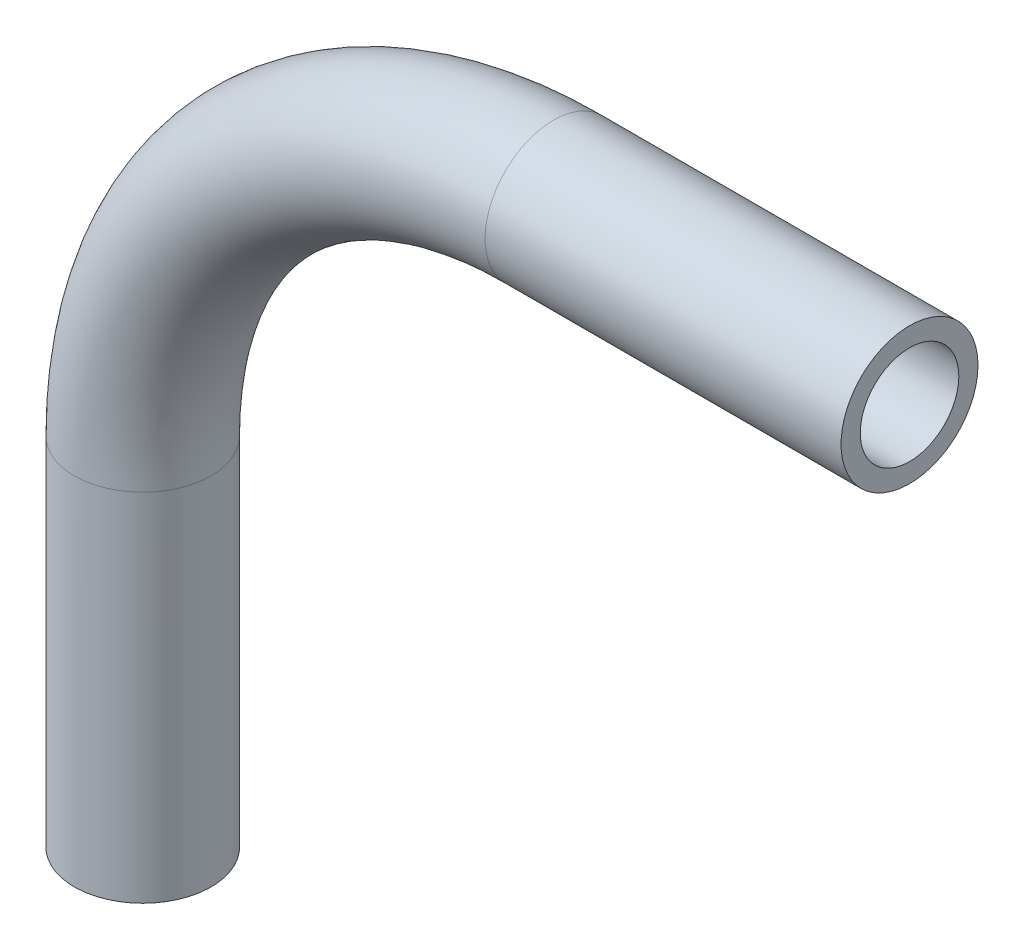
ISO-10303-21;
HEADER;
FILE_DESCRIPTION(('STEP AP214'),'2;1');
FILE_NAME('part.step','',(''),(''),'','','');
FILE_SCHEMA(('AUTOMOTIVE_DESIGN { 1 0 10303 214 1 1 1 1 }'));
ENDSEC;
DATA;
#1=APPLICATION_CONTEXT('core data for automotive mechanical design processes');
#2=APPLICATION_PROTOCOL_DEFINITION('international standard','automotive_design',2000,#1);
#3=PRODUCT_CONTEXT('',#1,'mechanical');
#4=PRODUCT('Part','Part','',(#3));
#5=PRODUCT_RELATED_PRODUCT_CATEGORY('part','',(#4));
#6=PRODUCT_DEFINITION_FORMATION('','',#4);
#7=PRODUCT_DEFINITION_CONTEXT('part definition',#1,'design');
#8=PRODUCT_DEFINITION('design','',#6,#7);
#9=PRODUCT_DEFINITION_SHAPE('','',#8);
#10=(LENGTH_UNIT() NAMED_UNIT(*) SI_UNIT(.MILLI.,.METRE.));
#11=(NAMED_UNIT(*) PLANE_ANGLE_UNIT() SI_UNIT($,.RADIAN.));
#12=(NAMED_UNIT(*) SI_UNIT($,.STERADIAN.) SOLID_ANGLE_UNIT());
#13=UNCERTAINTY_MEASURE_WITH_UNIT(LENGTH_MEASURE(1.E-05),#10,'distance_accuracy_value','');
#14=(GEOMETRIC_REPRESENTATION_CONTEXT(3) GLOBAL_UNCERTAINTY_ASSIGNED_CONTEXT((#13)) GLOBAL_UNIT_ASSIGNED_CONTEXT((#10,
#11,#12)) REPRESENTATION_CONTEXT('',''));
#15=CARTESIAN_POINT('',(0.,0.,0.));
#16=DIRECTION('',(0.,0.,1.));
#17=DIRECTION('',(1.,0.,0.));
#18=AXIS2_PLACEMENT_3D('',#15,#16,#17);
#19=CARTESIAN_POINT('',(0.,-18.0323178807947,0.));
#20=DIRECTION('',(0.,1.,0.));
#21=DIRECTION('',(0.,0.,1.));
#22=AXIS2_PLACEMENT_3D('',#19,#20,#21);
#23=CYLINDRICAL_SURFACE('',#22,3.175);
#24=CARTESIAN_POINT('',(0.,-1.52231788079483,0.));
#25=DIRECTION('',(0.,1.,0.));
#26=DIRECTION('',(0.,0.,-1.));
#27=AXIS2_PLACEMENT_3D('',#24,#25,#26);
#28=CIRCLE('',#27,3.175);
#29=CARTESIAN_POINT('',(-3.175,-1.52231788079486,0.));
#30=VERTEX_POINT('',#29);
#31=EDGE_CURVE('E79',#30,#30,#28,.T.);
#32=ORIENTED_EDGE('',*,*,#31,.F.);
#33=EDGE_LOOP('',(#32));
#34=FACE_BOUND('',#33,.T.);
#35=CARTESIAN_POINT('',(0.,-18.0323178807947,0.));
#36=DIRECTION('',(0.,1.,0.));
#37=DIRECTION('',(0.,0.,-1.));
#38=AXIS2_PLACEMENT_3D('',#35,#36,#37);
#39=CIRCLE('',#38,3.175);
#40=CARTESIAN_POINT('',(0.,-18.0323178807947,-3.175));
#41=VERTEX_POINT('',#40);
#42=EDGE_CURVE('E48',#41,#41,#39,.T.);
#43=ORIENTED_EDGE('',*,*,#42,.T.);
#44=EDGE_LOOP('',(#43));
#45=FACE_BOUND('',#44,.T.);
#46=ADVANCED_FACE('F33',(#34,#45),#23,.T.);
#47=CARTESIAN_POINT('',(19.05,-1.52231788079469,0.));
#48=DIRECTION('',(0.,0.,-1.));
#49=DIRECTION('',(-1.,0.,0.));
#50=AXIS2_PLACEMENT_3D('',#47,#48,#49);
#51=TOROIDAL_SURFACE('',#50,19.05,3.175);
#52=CARTESIAN_POINT('',(19.05,17.5276821192056,0.));
#53=DIRECTION('',(1.,0.,0.));
#54=DIRECTION('',(0.,0.,-1.));
#55=AXIS2_PLACEMENT_3D('',#52,#53,#54);
#56=CIRCLE('',#55,3.175);
#57=CARTESIAN_POINT('',(19.05,20.7026821192053,0.));
#58=VERTEX_POINT('',#57);
#59=EDGE_CURVE('E37',#58,#58,#56,.T.);
#60=CARTESIAN_POINT('',(19.05,-1.52231788079469,0.));
#61=DIRECTION('',(0.,0.,-1.));
#62=DIRECTION('',(-1.,0.,0.));
#63=AXIS2_PLACEMENT_3D('',#60,#61,#62);
#64=CIRCLE('',#63,22.225);
#65=EDGE_CURVE('',#30,#58,#64,.T.);
#66=ORIENTED_EDGE('',*,*,#31,.T.);
#67=ORIENTED_EDGE('',*,*,#59,.F.);
#68=ORIENTED_EDGE('',*,*,#65,.T.);
#69=ORIENTED_EDGE('',*,*,#65,.F.);
#70=EDGE_LOOP('',(#66,#68,#67,#69));
#71=FACE_BOUND('',#70,.T.);
#72=ADVANCED_FACE('F87',(#71),#51,.T.);
#73=CARTESIAN_POINT('',(19.0500000000001,17.5276821192053,0.));
#74=DIRECTION('',(1.,0.,0.));
#75=DIRECTION('',(0.,0.,-1.));
#76=AXIS2_PLACEMENT_3D('',#73,#74,#75);
#77=CYLINDRICAL_SURFACE('',#76,3.175);
#78=CARTESIAN_POINT('',(35.56,17.5276821192053,0.));
#79=DIRECTION('',(1.,0.,0.));
#80=DIRECTION('',(0.,0.,-1.));
#81=AXIS2_PLACEMENT_3D('',#78,#79,#80);
#82=CIRCLE('',#81,3.175);
#83=CARTESIAN_POINT('',(35.56,17.5276821192053,-3.175));
#84=VERTEX_POINT('',#83);
#85=EDGE_CURVE('E53',#84,#84,#82,.T.);
#86=ORIENTED_EDGE('',*,*,#85,.F.);
#87=EDGE_LOOP('',(#86));
#88=FACE_BOUND('',#87,.T.);
#89=ORIENTED_EDGE('',*,*,#59,.T.);
#90=EDGE_LOOP('',(#89));
#91=FACE_BOUND('',#90,.T.);
#92=ADVANCED_FACE('F35',(#88,#91),#77,.T.);
#93=CARTESIAN_POINT('',(0.,-18.0323178807947,0.));
#94=DIRECTION('',(0.,1.,0.));
#95=DIRECTION('',(0.,0.,-1.));
#96=AXIS2_PLACEMENT_3D('',#93,#94,#95);
#97=PLANE('',#96);
#98=CARTESIAN_POINT('',(0.,-18.0323178807947,0.));
#99=DIRECTION('',(0.,1.,0.));
#100=DIRECTION('',(0.,0.,-1.));
#101=AXIS2_PLACEMENT_3D('',#98,#99,#100);
#102=CIRCLE('',#101,2.286);
#103=CARTESIAN_POINT('',(0.,-18.0323178807947,-2.286));
#104=VERTEX_POINT('',#103);
#105=EDGE_CURVE('E74',#104,#104,#102,.F.);
#106=ORIENTED_EDGE('',*,*,#105,.F.);
#107=EDGE_LOOP('',(#106));
#108=FACE_BOUND('',#107,.T.);
#109=ORIENTED_EDGE('',*,*,#42,.F.);
#110=EDGE_LOOP('',(#109));
#111=FACE_BOUND('',#110,.T.);
#112=ADVANCED_FACE('F93',(#108,#111),#97,.F.);
#113=CARTESIAN_POINT('',(35.56,17.5276821192053,0.));
#114=DIRECTION('',(1.,0.,0.));
#115=DIRECTION('',(0.,0.,-1.));
#116=AXIS2_PLACEMENT_3D('',#113,#114,#115);
#117=PLANE('',#116);
#118=CARTESIAN_POINT('',(35.56,17.5276821192053,0.));
#119=DIRECTION('',(1.,0.,0.));
#120=DIRECTION('',(0.,0.,-1.));
#121=AXIS2_PLACEMENT_3D('',#118,#119,#120);
#122=CIRCLE('',#121,2.286);
#123=CARTESIAN_POINT('',(35.56,17.5276821192053,-2.286));
#124=VERTEX_POINT('',#123);
#125=EDGE_CURVE('E11',#124,#124,#122,.F.);
#126=ORIENTED_EDGE('',*,*,#125,.T.);
#127=EDGE_LOOP('',(#126));
#128=FACE_BOUND('',#127,.T.);
#129=ORIENTED_EDGE('',*,*,#85,.T.);
#130=EDGE_LOOP('',(#129));
#131=FACE_BOUND('',#130,.T.);
#132=ADVANCED_FACE('F60',(#128,#131),#117,.T.);
#133=CARTESIAN_POINT('',(0.,-18.0323178807947,0.));
#134=DIRECTION('',(0.,1.,0.));
#135=DIRECTION('',(0.,0.,1.));
#136=AXIS2_PLACEMENT_3D('',#133,#134,#135);
#137=CYLINDRICAL_SURFACE('',#136,2.286);
#138=CARTESIAN_POINT('',(0.,-1.52231788079483,0.));
#139=DIRECTION('',(0.,1.,0.));
#140=DIRECTION('',(0.,0.,-1.));
#141=AXIS2_PLACEMENT_3D('',#138,#139,#140);
#142=CIRCLE('',#141,2.286);
#143=CARTESIAN_POINT('',(-2.286,-1.52231788079485,0.));
#144=VERTEX_POINT('',#143);
#145=EDGE_CURVE('E71',#144,#144,#142,.F.);
#146=ORIENTED_EDGE('',*,*,#145,.F.);
#147=EDGE_LOOP('',(#146));
#148=FACE_BOUND('',#147,.T.);
#149=ORIENTED_EDGE('',*,*,#105,.T.);
#150=EDGE_LOOP('',(#149));
#151=FACE_BOUND('',#150,.T.);
#152=ADVANCED_FACE('F101',(#148,#151),#137,.F.);
#153=CARTESIAN_POINT('',(19.05,-1.52231788079469,0.));
#154=DIRECTION('',(0.,0.,-1.));
#155=DIRECTION('',(-1.,0.,0.));
#156=AXIS2_PLACEMENT_3D('',#153,#154,#155);
#157=TOROIDAL_SURFACE('',#156,19.05,2.286);
#158=CARTESIAN_POINT('',(19.05,17.5276821192056,0.));
#159=DIRECTION('',(1.,0.,0.));
#160=DIRECTION('',(0.,0.,-1.));
#161=AXIS2_PLACEMENT_3D('',#158,#159,#160);
#162=CIRCLE('',#161,2.286);
#163=CARTESIAN_POINT('',(19.05,19.8136821192053,0.));
#164=VERTEX_POINT('',#163);
#165=EDGE_CURVE('E42',#164,#164,#162,.F.);
#166=CARTESIAN_POINT('',(19.05,-1.52231788079469,0.));
#167=DIRECTION('',(0.,0.,-1.));
#168=DIRECTION('',(-1.,0.,0.));
#169=AXIS2_PLACEMENT_3D('',#166,#167,#168);
#170=CIRCLE('',#169,21.336);
#171=EDGE_CURVE('',#144,#164,#170,.T.);
#172=ORIENTED_EDGE('',*,*,#145,.T.);
#173=ORIENTED_EDGE('',*,*,#165,.F.);
#174=ORIENTED_EDGE('',*,*,#171,.T.);
#175=ORIENTED_EDGE('',*,*,#171,.F.);
#176=EDGE_LOOP('',(#172,#174,#173,#175));
#177=FACE_BOUND('',#176,.T.);
#178=ADVANCED_FACE('F66',(#177),#157,.F.);
#179=CARTESIAN_POINT('',(19.0500000000001,17.5276821192053,0.));
#180=DIRECTION('',(1.,0.,0.));
#181=DIRECTION('',(0.,0.,-1.));
#182=AXIS2_PLACEMENT_3D('',#179,#180,#181);
#183=CYLINDRICAL_SURFACE('',#182,2.286);
#184=ORIENTED_EDGE('',*,*,#125,.F.);
#185=EDGE_LOOP('',(#184));
#186=FACE_BOUND('',#185,.T.);
#187=ORIENTED_EDGE('',*,*,#165,.T.);
#188=EDGE_LOOP('',(#187));
#189=FACE_BOUND('',#188,.T.);
#190=ADVANCED_FACE('F63',(#186,#189),#183,.F.);
#191=CLOSED_SHELL('',(#46,#72,#92,#112,#132,#152,#178,#190));
#192=MANIFOLD_SOLID_BREP('B2',#191);
#193=ADVANCED_BREP_SHAPE_REPRESENTATION('',(#18,#192),#14);
#194=SHAPE_DEFINITION_REPRESENTATION(#9,#193);
ENDSEC;
END-ISO-10303-21;
